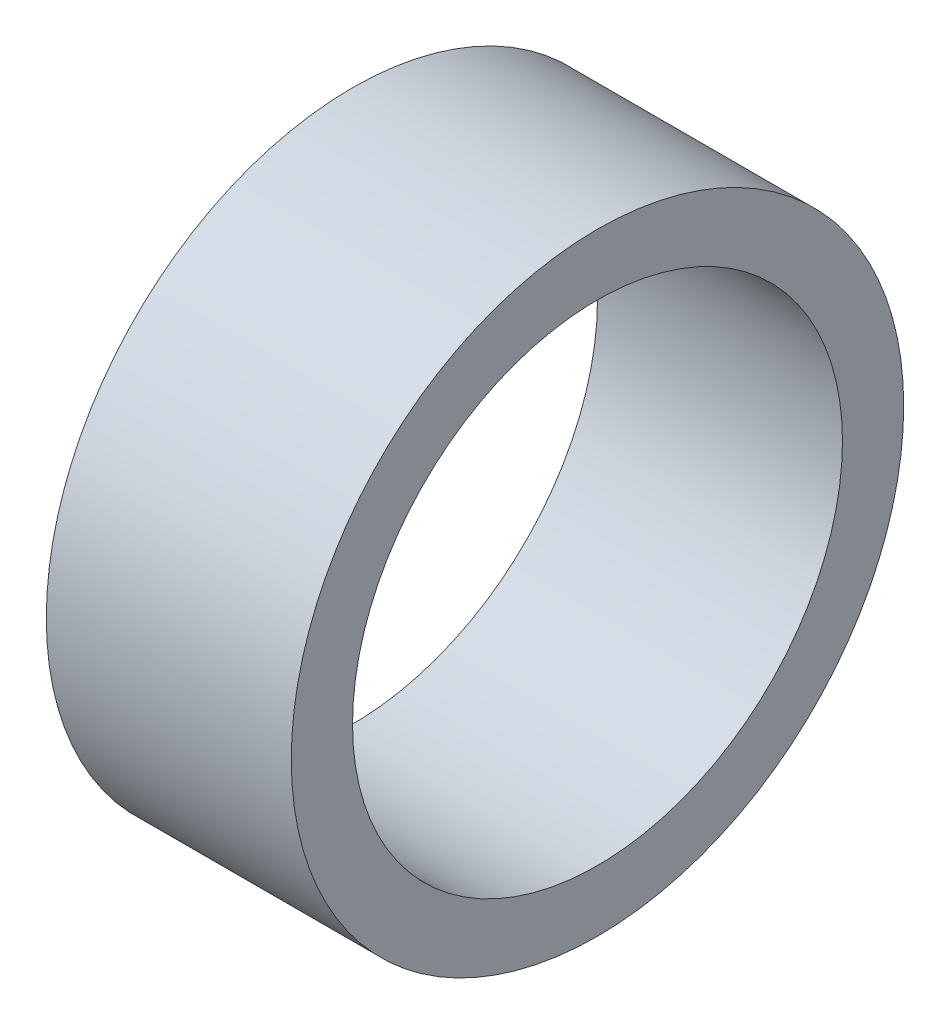
ISO-10303-21;
HEADER;
FILE_DESCRIPTION(('STEP AP214'),'2;1');
FILE_NAME('part.step','',(''),(''),'','','');
FILE_SCHEMA(('AUTOMOTIVE_DESIGN { 1 0 10303 214 1 1 1 1 }'));
ENDSEC;
DATA;
#1=APPLICATION_CONTEXT('core data for automotive mechanical design processes');
#2=APPLICATION_PROTOCOL_DEFINITION('international standard','automotive_design',2000,#1);
#3=PRODUCT_CONTEXT('',#1,'mechanical');
#4=PRODUCT('Part','Part','',(#3));
#5=PRODUCT_RELATED_PRODUCT_CATEGORY('part','',(#4));
#6=PRODUCT_DEFINITION_FORMATION('','',#4);
#7=PRODUCT_DEFINITION_CONTEXT('part definition',#1,'design');
#8=PRODUCT_DEFINITION('design','',#6,#7);
#9=PRODUCT_DEFINITION_SHAPE('','',#8);
#10=(LENGTH_UNIT() NAMED_UNIT(*) SI_UNIT(.MILLI.,.METRE.));
#11=(NAMED_UNIT(*) PLANE_ANGLE_UNIT() SI_UNIT($,.RADIAN.));
#12=(NAMED_UNIT(*) SI_UNIT($,.STERADIAN.) SOLID_ANGLE_UNIT());
#13=UNCERTAINTY_MEASURE_WITH_UNIT(LENGTH_MEASURE(1.E-05),#10,'distance_accuracy_value','');
#14=(GEOMETRIC_REPRESENTATION_CONTEXT(3) GLOBAL_UNCERTAINTY_ASSIGNED_CONTEXT((#13)) GLOBAL_UNIT_ASSIGNED_CONTEXT((#10,
#11,#12)) REPRESENTATION_CONTEXT('',''));
#15=CARTESIAN_POINT('',(0.,0.,0.));
#16=DIRECTION('',(0.,0.,1.));
#17=DIRECTION('',(1.,0.,0.));
#18=AXIS2_PLACEMENT_3D('',#15,#16,#17);
#19=CARTESIAN_POINT('',(5.,0.,0.));
#20=DIRECTION('',(1.,0.,0.));
#21=DIRECTION('',(0.,0.,-1.));
#22=AXIS2_PLACEMENT_3D('',#19,#20,#21);
#23=PLANE('',#22);
#24=CARTESIAN_POINT('',(5.,0.,0.));
#25=DIRECTION('',(1.,0.,0.));
#26=DIRECTION('',(0.,0.,-1.));
#27=AXIS2_PLACEMENT_3D('',#24,#25,#26);
#28=CIRCLE('',#27,6.25);
#29=CARTESIAN_POINT('',(5.,0.,-6.25));
#30=VERTEX_POINT('',#29);
#31=EDGE_CURVE('E10',#30,#30,#28,.T.);
#32=ORIENTED_EDGE('',*,*,#31,.T.);
#33=EDGE_LOOP('',(#32));
#34=FACE_BOUND('',#33,.T.);
#35=CARTESIAN_POINT('',(5.,0.,0.));
#36=DIRECTION('',(1.,0.,0.));
#37=DIRECTION('',(0.,0.,-1.));
#38=AXIS2_PLACEMENT_3D('',#35,#36,#37);
#39=CIRCLE('',#38,5.);
#40=CARTESIAN_POINT('',(5.,0.,-5.));
#41=VERTEX_POINT('',#40);
#42=EDGE_CURVE('E54',#41,#41,#39,.T.);
#43=ORIENTED_EDGE('',*,*,#42,.F.);
#44=EDGE_LOOP('',(#43));
#45=FACE_BOUND('',#44,.T.);
#46=ADVANCED_FACE('F41',(#34,#45),#23,.T.);
#47=CARTESIAN_POINT('',(0.,0.,0.));
#48=DIRECTION('',(1.,0.,0.));
#49=DIRECTION('',(0.,0.,-1.));
#50=AXIS2_PLACEMENT_3D('',#47,#48,#49);
#51=PLANE('',#50);
#52=CARTESIAN_POINT('',(0.,0.,0.));
#53=DIRECTION('',(1.,0.,0.));
#54=DIRECTION('',(0.,0.,-1.));
#55=AXIS2_PLACEMENT_3D('',#52,#53,#54);
#56=CIRCLE('',#55,6.25);
#57=CARTESIAN_POINT('',(0.,0.,-6.25));
#58=VERTEX_POINT('',#57);
#59=EDGE_CURVE('E45',#58,#58,#56,.T.);
#60=ORIENTED_EDGE('',*,*,#59,.F.);
#61=EDGE_LOOP('',(#60));
#62=FACE_BOUND('',#61,.T.);
#63=CARTESIAN_POINT('',(0.,0.,0.));
#64=DIRECTION('',(1.,0.,0.));
#65=DIRECTION('',(0.,0.,-1.));
#66=AXIS2_PLACEMENT_3D('',#63,#64,#65);
#67=CIRCLE('',#66,5.);
#68=CARTESIAN_POINT('',(0.,0.,-5.));
#69=VERTEX_POINT('',#68);
#70=EDGE_CURVE('E56',#69,#69,#67,.T.);
#71=ORIENTED_EDGE('',*,*,#70,.T.);
#72=EDGE_LOOP('',(#71));
#73=FACE_BOUND('',#72,.T.);
#74=ADVANCED_FACE('F68',(#62,#73),#51,.F.);
#75=CARTESIAN_POINT('',(5.,0.,0.));
#76=DIRECTION('',(-1.,0.,0.));
#77=DIRECTION('',(0.,0.,1.));
#78=AXIS2_PLACEMENT_3D('',#75,#76,#77);
#79=CYLINDRICAL_SURFACE('',#78,6.25);
#80=ORIENTED_EDGE('',*,*,#31,.F.);
#81=EDGE_LOOP('',(#80));
#82=FACE_BOUND('',#81,.T.);
#83=ORIENTED_EDGE('',*,*,#59,.T.);
#84=EDGE_LOOP('',(#83));
#85=FACE_BOUND('',#84,.T.);
#86=ADVANCED_FACE('F43',(#82,#85),#79,.T.);
#87=CARTESIAN_POINT('',(5.,0.,0.));
#88=DIRECTION('',(-1.,0.,0.));
#89=DIRECTION('',(0.,0.,1.));
#90=AXIS2_PLACEMENT_3D('',#87,#88,#89);
#91=CYLINDRICAL_SURFACE('',#90,5.);
#92=ORIENTED_EDGE('',*,*,#42,.T.);
#93=EDGE_LOOP('',(#92));
#94=FACE_BOUND('',#93,.T.);
#95=ORIENTED_EDGE('',*,*,#70,.F.);
#96=EDGE_LOOP('',(#95));
#97=FACE_BOUND('',#96,.T.);
#98=ADVANCED_FACE('F64',(#94,#97),#91,.F.);
#99=CLOSED_SHELL('',(#46,#74,#86,#98));
#100=MANIFOLD_SOLID_BREP('B2',#99);
#101=ADVANCED_BREP_SHAPE_REPRESENTATION('',(#18,#100),#14);
#102=SHAPE_DEFINITION_REPRESENTATION(#9,#101);
ENDSEC;
END-ISO-10303-21;
